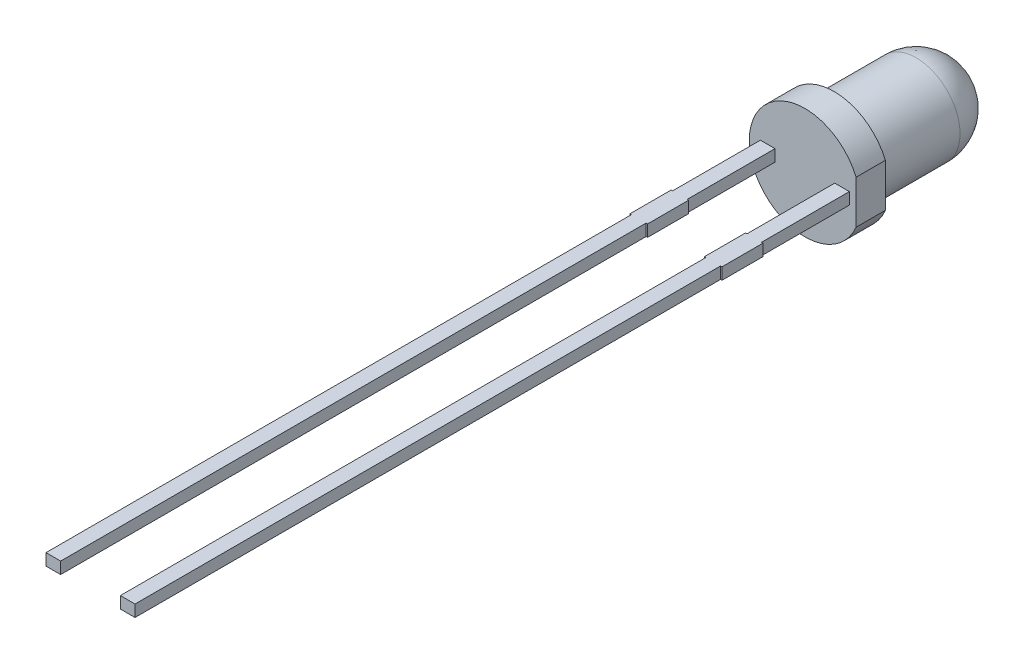
ISO-10303-21;
HEADER;
FILE_DESCRIPTION(('STEP AP214'),'2;1');
FILE_NAME('part.step','',(''),(''),'','','');
FILE_SCHEMA(('AUTOMOTIVE_DESIGN { 1 0 10303 214 1 1 1 1 }'));
ENDSEC;
DATA;
#1=APPLICATION_CONTEXT('core data for automotive mechanical design processes');
#2=APPLICATION_PROTOCOL_DEFINITION('international standard','automotive_design',2000,#1);
#3=PRODUCT_CONTEXT('',#1,'mechanical');
#4=PRODUCT('Part','Part','',(#3));
#5=PRODUCT_RELATED_PRODUCT_CATEGORY('part','',(#4));
#6=PRODUCT_DEFINITION_FORMATION('','',#4);
#7=PRODUCT_DEFINITION_CONTEXT('part definition',#1,'design');
#8=PRODUCT_DEFINITION('design','',#6,#7);
#9=PRODUCT_DEFINITION_SHAPE('','',#8);
#10=(LENGTH_UNIT() NAMED_UNIT(*) SI_UNIT(.MILLI.,.METRE.));
#11=(NAMED_UNIT(*) PLANE_ANGLE_UNIT() SI_UNIT($,.RADIAN.));
#12=(NAMED_UNIT(*) SI_UNIT($,.STERADIAN.) SOLID_ANGLE_UNIT());
#13=UNCERTAINTY_MEASURE_WITH_UNIT(LENGTH_MEASURE(1.E-05),#10,'distance_accuracy_value','');
#14=(GEOMETRIC_REPRESENTATION_CONTEXT(3) GLOBAL_UNCERTAINTY_ASSIGNED_CONTEXT((#13)) GLOBAL_UNIT_ASSIGNED_CONTEXT((#10,
#11,#12)) REPRESENTATION_CONTEXT('',''));
#15=CARTESIAN_POINT('',(0.,0.,0.));
#16=DIRECTION('',(0.,0.,1.));
#17=DIRECTION('',(1.,0.,0.));
#18=AXIS2_PLACEMENT_3D('',#15,#16,#17);
#19=CARTESIAN_POINT('',(-1.57,-0.2,5.4));
#20=DIRECTION('',(1.,0.,0.));
#21=DIRECTION('',(0.,0.,-1.));
#22=AXIS2_PLACEMENT_3D('',#19,#20,#21);
#23=PLANE('',#22);
#24=DIRECTION('',(0.,0.,1.));
#25=VECTOR('',#24,1.);
#26=CARTESIAN_POINT('',(-1.57,-0.2,4.));
#27=LINE('',#26,#25);
#28=CARTESIAN_POINT('',(-1.57,-0.2,4.));
#29=VERTEX_POINT('',#28);
#30=CARTESIAN_POINT('',(-1.57,-0.2,5.4));
#31=VERTEX_POINT('',#30);
#32=EDGE_CURVE('P0_E385',#29,#31,#27,.T.);
#33=ORIENTED_EDGE('',*,*,#32,.T.);
#34=DIRECTION('',(0.,-1.,0.));
#35=VECTOR('',#34,1.);
#36=CARTESIAN_POINT('',(-1.57,0.2,5.4));
#37=LINE('',#36,#35);
#38=CARTESIAN_POINT('',(-1.57,0.2,5.4));
#39=VERTEX_POINT('',#38);
#40=EDGE_CURVE('P0_E465',#39,#31,#37,.T.);
#41=ORIENTED_EDGE('',*,*,#40,.F.);
#42=DIRECTION('',(0.,0.,-1.));
#43=VECTOR('',#42,1.);
#44=CARTESIAN_POINT('',(-1.57,0.2,4.));
#45=LINE('',#44,#43);
#46=CARTESIAN_POINT('',(-1.57,0.2,4.));
#47=VERTEX_POINT('',#46);
#48=EDGE_CURVE('P0_E414',#39,#47,#45,.T.);
#49=ORIENTED_EDGE('',*,*,#48,.T.);
#50=DIRECTION('',(0.,1.,0.));
#51=VECTOR('',#50,1.);
#52=CARTESIAN_POINT('',(-1.57,0.2,4.));
#53=LINE('',#52,#51);
#54=EDGE_CURVE('P0_E402',#29,#47,#53,.T.);
#55=ORIENTED_EDGE('',*,*,#54,.F.);
#56=EDGE_LOOP('',(#33,#41,#49,#55));
#57=FACE_BOUND('',#56,.T.);
#58=ADVANCED_FACE('P0_F48',(#57),#23,.F.);
#59=CARTESIAN_POINT('',(-1.02,0.2,25.4));
#60=DIRECTION('',(0.,0.,-1.));
#61=DIRECTION('',(-1.,0.,0.));
#62=AXIS2_PLACEMENT_3D('',#59,#60,#61);
#63=PLANE('',#62);
#64=DIRECTION('',(-1.,0.,0.));
#65=VECTOR('',#64,1.);
#66=CARTESIAN_POINT('',(-1.52,-0.2,25.4));
#67=LINE('',#66,#65);
#68=CARTESIAN_POINT('',(-1.52,-0.2,25.4));
#69=VERTEX_POINT('',#68);
#70=CARTESIAN_POINT('',(-1.02,-0.2,25.4));
#71=VERTEX_POINT('',#70);
#72=EDGE_CURVE('P0_E376',#69,#71,#67,.F.);
#73=ORIENTED_EDGE('',*,*,#72,.T.);
#74=DIRECTION('',(0.,-1.,0.));
#75=VECTOR('',#74,1.);
#76=CARTESIAN_POINT('',(-1.02,0.2,25.4));
#77=LINE('',#76,#75);
#78=CARTESIAN_POINT('',(-1.02,0.2,25.4));
#79=VERTEX_POINT('',#78);
#80=EDGE_CURVE('P0_E377',#79,#71,#77,.T.);
#81=ORIENTED_EDGE('',*,*,#80,.F.);
#82=DIRECTION('',(1.,0.,0.));
#83=VECTOR('',#82,1.);
#84=CARTESIAN_POINT('',(-1.52,0.2,25.4));
#85=LINE('',#84,#83);
#86=CARTESIAN_POINT('',(-1.52,0.2,25.4));
#87=VERTEX_POINT('',#86);
#88=EDGE_CURVE('P0_E416',#79,#87,#85,.F.);
#89=ORIENTED_EDGE('',*,*,#88,.T.);
#90=DIRECTION('',(0.,-1.,0.));
#91=VECTOR('',#90,1.);
#92=CARTESIAN_POINT('',(-1.52,0.2,25.4));
#93=LINE('',#92,#91);
#94=EDGE_CURVE('P0_E380',#87,#69,#93,.T.);
#95=ORIENTED_EDGE('',*,*,#94,.T.);
#96=EDGE_LOOP('',(#73,#81,#89,#95));
#97=FACE_BOUND('',#96,.T.);
#98=ADVANCED_FACE('P0_F364',(#97),#63,.F.);
#99=CARTESIAN_POINT('',(-0.97,-0.2,5.4));
#100=DIRECTION('',(-1.,0.,0.));
#101=DIRECTION('',(0.,0.,1.));
#102=AXIS2_PLACEMENT_3D('',#99,#100,#101);
#103=PLANE('',#102);
#104=DIRECTION('',(0.,0.,-1.));
#105=VECTOR('',#104,1.);
#106=CARTESIAN_POINT('',(-0.97,0.2,4.));
#107=LINE('',#106,#105);
#108=CARTESIAN_POINT('',(-0.97,0.2,4.));
#109=VERTEX_POINT('',#108);
#110=CARTESIAN_POINT('',(-0.97,0.2,5.4));
#111=VERTEX_POINT('',#110);
#112=EDGE_CURVE('P0_E419',#109,#111,#107,.F.);
#113=ORIENTED_EDGE('',*,*,#112,.T.);
#114=DIRECTION('',(0.,-1.,0.));
#115=VECTOR('',#114,1.);
#116=CARTESIAN_POINT('',(-0.97,0.2,5.4));
#117=LINE('',#116,#115);
#118=CARTESIAN_POINT('',(-0.97,-0.2,5.4));
#119=VERTEX_POINT('',#118);
#120=EDGE_CURVE('P0_E586',#111,#119,#117,.T.);
#121=ORIENTED_EDGE('',*,*,#120,.T.);
#122=DIRECTION('',(0.,0.,1.));
#123=VECTOR('',#122,1.);
#124=CARTESIAN_POINT('',(-0.97,-0.2,4.));
#125=LINE('',#124,#123);
#126=CARTESIAN_POINT('',(-0.97,-0.2,4.));
#127=VERTEX_POINT('',#126);
#128=EDGE_CURVE('P0_E384',#119,#127,#125,.F.);
#129=ORIENTED_EDGE('',*,*,#128,.T.);
#130=DIRECTION('',(0.,1.,0.));
#131=VECTOR('',#130,1.);
#132=CARTESIAN_POINT('',(-0.97,0.2,4.));
#133=LINE('',#132,#131);
#134=EDGE_CURVE('P0_E446',#109,#127,#133,.F.);
#135=ORIENTED_EDGE('',*,*,#134,.F.);
#136=EDGE_LOOP('',(#113,#121,#129,#135));
#137=FACE_BOUND('',#136,.T.);
#138=ADVANCED_FACE('P0_F361',(#137),#103,.F.);
#139=CARTESIAN_POINT('',(-0.97,0.2,4.));
#140=DIRECTION('',(0.,0.,-1.));
#141=DIRECTION('',(-1.,0.,0.));
#142=AXIS2_PLACEMENT_3D('',#139,#140,#141);
#143=PLANE('',#142);
#144=DIRECTION('',(1.,0.,0.));
#145=VECTOR('',#144,1.);
#146=CARTESIAN_POINT('',(-1.52,0.2,4.));
#147=LINE('',#146,#145);
#148=CARTESIAN_POINT('',(-1.02,0.2,4.));
#149=VERTEX_POINT('',#148);
#150=EDGE_CURVE('P0_E423',#149,#109,#147,.T.);
#151=ORIENTED_EDGE('',*,*,#150,.T.);
#152=ORIENTED_EDGE('',*,*,#134,.T.);
#153=DIRECTION('',(-1.,0.,0.));
#154=VECTOR('',#153,1.);
#155=CARTESIAN_POINT('',(-1.52,-0.2,4.));
#156=LINE('',#155,#154);
#157=CARTESIAN_POINT('',(-1.02,-0.2,4.));
#158=VERTEX_POINT('',#157);
#159=EDGE_CURVE('P0_E391',#127,#158,#156,.T.);
#160=ORIENTED_EDGE('',*,*,#159,.T.);
#161=DIRECTION('',(0.,1.,0.));
#162=VECTOR('',#161,1.);
#163=CARTESIAN_POINT('',(-1.02,-0.2,4.));
#164=LINE('',#163,#162);
#165=EDGE_CURVE('P0_E443',#158,#149,#164,.T.);
#166=ORIENTED_EDGE('',*,*,#165,.T.);
#167=EDGE_LOOP('',(#151,#152,#160,#166));
#168=FACE_BOUND('',#167,.T.);
#169=ADVANCED_FACE('P0_F357',(#168),#143,.T.);
#170=CARTESIAN_POINT('',(-1.02,-0.2,4.));
#171=DIRECTION('',(-1.,0.,0.));
#172=DIRECTION('',(0.,0.,1.));
#173=AXIS2_PLACEMENT_3D('',#170,#171,#172);
#174=PLANE('',#173);
#175=DIRECTION('',(0.,0.,-1.));
#176=VECTOR('',#175,1.);
#177=CARTESIAN_POINT('',(-1.02,0.2,4.));
#178=LINE('',#177,#176);
#179=CARTESIAN_POINT('',(-1.02,0.2,1.));
#180=VERTEX_POINT('',#179);
#181=EDGE_CURVE('P0_E427',#180,#149,#178,.F.);
#182=ORIENTED_EDGE('',*,*,#181,.T.);
#183=ORIENTED_EDGE('',*,*,#165,.F.);
#184=DIRECTION('',(0.,0.,1.));
#185=VECTOR('',#184,1.);
#186=CARTESIAN_POINT('',(-1.02,-0.2,4.));
#187=LINE('',#186,#185);
#188=CARTESIAN_POINT('',(-1.02,-0.2,1.));
#189=VERTEX_POINT('',#188);
#190=EDGE_CURVE('P0_E563',#158,#189,#187,.F.);
#191=ORIENTED_EDGE('',*,*,#190,.T.);
#192=DIRECTION('',(0.,1.,0.));
#193=VECTOR('',#192,1.);
#194=CARTESIAN_POINT('',(-1.02,-0.2,1.));
#195=LINE('',#194,#193);
#196=EDGE_CURVE('P0_E440',#180,#189,#195,.F.);
#197=ORIENTED_EDGE('',*,*,#196,.F.);
#198=EDGE_LOOP('',(#182,#183,#191,#197));
#199=FACE_BOUND('',#198,.T.);
#200=ADVANCED_FACE('P0_F353',(#199),#174,.F.);
#201=CARTESIAN_POINT('',(0.97,-0.2,5.4));
#202=DIRECTION('',(1.,0.,0.));
#203=DIRECTION('',(0.,1.,0.));
#204=AXIS2_PLACEMENT_3D('',#201,#202,#203);
#205=PLANE('',#204);
#206=DIRECTION('',(0.,0.,1.));
#207=VECTOR('',#206,1.);
#208=CARTESIAN_POINT('',(0.97,-0.2,4.));
#209=LINE('',#208,#207);
#210=CARTESIAN_POINT('',(0.97,-0.2,4.));
#211=VERTEX_POINT('',#210);
#212=CARTESIAN_POINT('',(0.97,-0.2,5.4));
#213=VERTEX_POINT('',#212);
#214=EDGE_CURVE('P0_E524',#211,#213,#209,.T.);
#215=ORIENTED_EDGE('',*,*,#214,.T.);
#216=DIRECTION('',(0.,-1.,0.));
#217=VECTOR('',#216,1.);
#218=CARTESIAN_POINT('',(0.97,0.2,5.4));
#219=LINE('',#218,#217);
#220=CARTESIAN_POINT('',(0.97,0.2,5.4));
#221=VERTEX_POINT('',#220);
#222=EDGE_CURVE('P0_E72',#221,#213,#219,.T.);
#223=ORIENTED_EDGE('',*,*,#222,.F.);
#224=DIRECTION('',(0.,0.,-1.));
#225=VECTOR('',#224,1.);
#226=CARTESIAN_POINT('',(0.97,0.2,4.));
#227=LINE('',#226,#225);
#228=CARTESIAN_POINT('',(0.969999999999997,0.2,4.));
#229=VERTEX_POINT('',#228);
#230=EDGE_CURVE('P0_E543',#221,#229,#227,.T.);
#231=ORIENTED_EDGE('',*,*,#230,.T.);
#232=DIRECTION('',(0.,1.,0.));
#233=VECTOR('',#232,1.);
#234=CARTESIAN_POINT('',(0.97,0.2,4.));
#235=LINE('',#234,#233);
#236=EDGE_CURVE('P0_E536',#229,#211,#235,.F.);
#237=ORIENTED_EDGE('',*,*,#236,.T.);
#238=EDGE_LOOP('',(#215,#223,#231,#237));
#239=FACE_BOUND('',#238,.T.);
#240=ADVANCED_FACE('P0_F349',(#239),#205,.F.);
#241=CARTESIAN_POINT('',(1.52,0.2,25.4));
#242=DIRECTION('',(0.,0.,1.));
#243=DIRECTION('',(1.,0.,0.));
#244=AXIS2_PLACEMENT_3D('',#241,#242,#243);
#245=PLANE('',#244);
#246=DIRECTION('',(0.,-1.,0.));
#247=VECTOR('',#246,1.);
#248=CARTESIAN_POINT('',(1.52,0.2,25.4));
#249=LINE('',#248,#247);
#250=CARTESIAN_POINT('',(1.52,0.2,25.4));
#251=VERTEX_POINT('',#250);
#252=CARTESIAN_POINT('',(1.52,-0.2,25.4));
#253=VERTEX_POINT('',#252);
#254=EDGE_CURVE('P0_E64',#251,#253,#249,.T.);
#255=ORIENTED_EDGE('',*,*,#254,.F.);
#256=DIRECTION('',(1.,0.,0.));
#257=VECTOR('',#256,1.);
#258=CARTESIAN_POINT('',(1.52,0.2,25.4));
#259=LINE('',#258,#257);
#260=CARTESIAN_POINT('',(1.02,0.2,25.4));
#261=VERTEX_POINT('',#260);
#262=EDGE_CURVE('P0_E546',#251,#261,#259,.F.);
#263=ORIENTED_EDGE('',*,*,#262,.T.);
#264=DIRECTION('',(0.,-1.,0.));
#265=VECTOR('',#264,1.);
#266=CARTESIAN_POINT('',(1.02,0.2,25.4));
#267=LINE('',#266,#265);
#268=CARTESIAN_POINT('',(1.02,-0.2,25.4));
#269=VERTEX_POINT('',#268);
#270=EDGE_CURVE('P0_E594',#261,#269,#267,.T.);
#271=ORIENTED_EDGE('',*,*,#270,.T.);
#272=DIRECTION('',(-1.,0.,0.));
#273=VECTOR('',#272,1.);
#274=CARTESIAN_POINT('',(1.52,-0.2,25.4));
#275=LINE('',#274,#273);
#276=EDGE_CURVE('P0_E520',#269,#253,#275,.F.);
#277=ORIENTED_EDGE('',*,*,#276,.T.);
#278=EDGE_LOOP('',(#255,#263,#271,#277));
#279=FACE_BOUND('',#278,.T.);
#280=ADVANCED_FACE('P0_F345',(#279),#245,.T.);
#281=CARTESIAN_POINT('',(1.57,-0.2,5.4));
#282=DIRECTION('',(-1.,0.,0.));
#283=DIRECTION('',(0.,-1.,0.));
#284=AXIS2_PLACEMENT_3D('',#281,#282,#283);
#285=PLANE('',#284);
#286=DIRECTION('',(0.,0.,-1.));
#287=VECTOR('',#286,1.);
#288=CARTESIAN_POINT('',(1.57,0.2,4.));
#289=LINE('',#288,#287);
#290=CARTESIAN_POINT('',(1.57,0.2,4.));
#291=VERTEX_POINT('',#290);
#292=CARTESIAN_POINT('',(1.57,0.2,5.4));
#293=VERTEX_POINT('',#292);
#294=EDGE_CURVE('P0_E548',#291,#293,#289,.F.);
#295=ORIENTED_EDGE('',*,*,#294,.T.);
#296=DIRECTION('',(0.,-1.,0.));
#297=VECTOR('',#296,1.);
#298=CARTESIAN_POINT('',(1.57,0.2,5.4));
#299=LINE('',#298,#297);
#300=CARTESIAN_POINT('',(1.57,-0.2,5.4));
#301=VERTEX_POINT('',#300);
#302=EDGE_CURVE('P0_E633',#293,#301,#299,.T.);
#303=ORIENTED_EDGE('',*,*,#302,.T.);
#304=DIRECTION('',(0.,0.,1.));
#305=VECTOR('',#304,1.);
#306=CARTESIAN_POINT('',(1.57,-0.2,4.));
#307=LINE('',#306,#305);
#308=CARTESIAN_POINT('',(1.57,-0.2,4.));
#309=VERTEX_POINT('',#308);
#310=EDGE_CURVE('P0_E517',#301,#309,#307,.F.);
#311=ORIENTED_EDGE('',*,*,#310,.T.);
#312=DIRECTION('',(0.,1.,0.));
#313=VECTOR('',#312,1.);
#314=CARTESIAN_POINT('',(1.57,0.2,4.));
#315=LINE('',#314,#313);
#316=EDGE_CURVE('P0_E437',#309,#291,#315,.T.);
#317=ORIENTED_EDGE('',*,*,#316,.T.);
#318=EDGE_LOOP('',(#295,#303,#311,#317));
#319=FACE_BOUND('',#318,.T.);
#320=ADVANCED_FACE('P0_F341',(#319),#285,.F.);
#321=CARTESIAN_POINT('',(1.57,0.2,4.));
#322=DIRECTION('',(0.,0.,1.));
#323=DIRECTION('',(1.,0.,0.));
#324=AXIS2_PLACEMENT_3D('',#321,#322,#323);
#325=PLANE('',#324);
#326=DIRECTION('',(0.,1.,0.));
#327=VECTOR('',#326,1.);
#328=CARTESIAN_POINT('',(1.52,-0.2,4.));
#329=LINE('',#328,#327);
#330=CARTESIAN_POINT('',(1.52,-0.2,4.));
#331=VERTEX_POINT('',#330);
#332=CARTESIAN_POINT('',(1.52,0.2,4.));
#333=VERTEX_POINT('',#332);
#334=EDGE_CURVE('P0_E434',#331,#333,#329,.T.);
#335=ORIENTED_EDGE('',*,*,#334,.T.);
#336=DIRECTION('',(1.,0.,0.));
#337=VECTOR('',#336,1.);
#338=CARTESIAN_POINT('',(1.52,0.2,4.));
#339=LINE('',#338,#337);
#340=EDGE_CURVE('P0_E552',#333,#291,#339,.T.);
#341=ORIENTED_EDGE('',*,*,#340,.T.);
#342=ORIENTED_EDGE('',*,*,#316,.F.);
#343=DIRECTION('',(-1.,0.,0.));
#344=VECTOR('',#343,1.);
#345=CARTESIAN_POINT('',(1.52,-0.2,4.));
#346=LINE('',#345,#344);
#347=EDGE_CURVE('P0_E514',#309,#331,#346,.T.);
#348=ORIENTED_EDGE('',*,*,#347,.T.);
#349=EDGE_LOOP('',(#335,#341,#342,#348));
#350=FACE_BOUND('',#349,.T.);
#351=ADVANCED_FACE('P0_F337',(#350),#325,.F.);
#352=CARTESIAN_POINT('',(1.52,-0.2,4.));
#353=DIRECTION('',(-1.,0.,0.));
#354=DIRECTION('',(0.,0.,1.));
#355=AXIS2_PLACEMENT_3D('',#352,#353,#354);
#356=PLANE('',#355);
#357=DIRECTION('',(0.,0.,-1.));
#358=VECTOR('',#357,1.);
#359=CARTESIAN_POINT('',(1.52,0.2,4.));
#360=LINE('',#359,#358);
#361=CARTESIAN_POINT('',(1.52,0.2,1.));
#362=VERTEX_POINT('',#361);
#363=EDGE_CURVE('P0_E556',#362,#333,#360,.F.);
#364=ORIENTED_EDGE('',*,*,#363,.T.);
#365=ORIENTED_EDGE('',*,*,#334,.F.);
#366=DIRECTION('',(0.,0.,1.));
#367=VECTOR('',#366,1.);
#368=CARTESIAN_POINT('',(1.52,-0.2,4.));
#369=LINE('',#368,#367);
#370=CARTESIAN_POINT('',(1.52,-0.2,1.));
#371=VERTEX_POINT('',#370);
#372=EDGE_CURVE('P0_E510',#331,#371,#369,.F.);
#373=ORIENTED_EDGE('',*,*,#372,.T.);
#374=DIRECTION('',(0.,1.,0.));
#375=VECTOR('',#374,1.);
#376=CARTESIAN_POINT('',(1.52,-0.2,1.));
#377=LINE('',#376,#375);
#378=EDGE_CURVE('P0_E431',#362,#371,#377,.F.);
#379=ORIENTED_EDGE('',*,*,#378,.F.);
#380=EDGE_LOOP('',(#364,#365,#373,#379));
#381=FACE_BOUND('',#380,.T.);
#382=ADVANCED_FACE('P0_F333',(#381),#356,.F.);
#383=CARTESIAN_POINT('',(-1.52,0.2,4.));
#384=DIRECTION('',(0.,-1.,0.));
#385=DIRECTION('',(0.,0.,-1.));
#386=AXIS2_PLACEMENT_3D('',#383,#384,#385);
#387=PLANE('',#386);
#388=DIRECTION('',(0.,0.,-1.));
#389=VECTOR('',#388,1.);
#390=CARTESIAN_POINT('',(-1.02,0.2,25.4));
#391=LINE('',#390,#389);
#392=CARTESIAN_POINT('',(-1.02,0.2,5.4));
#393=VERTEX_POINT('',#392);
#394=EDGE_CURVE('P0_E591',#79,#393,#391,.T.);
#395=ORIENTED_EDGE('',*,*,#394,.T.);
#396=DIRECTION('',(1.,0.,0.));
#397=VECTOR('',#396,1.);
#398=CARTESIAN_POINT('',(-1.02,0.2,5.4));
#399=LINE('',#398,#397);
#400=EDGE_CURVE('P0_E584',#393,#111,#399,.T.);
#401=ORIENTED_EDGE('',*,*,#400,.T.);
#402=ORIENTED_EDGE('',*,*,#112,.F.);
#403=ORIENTED_EDGE('',*,*,#150,.F.);
#404=ORIENTED_EDGE('',*,*,#181,.F.);
#405=DIRECTION('',(1.,0.,0.));
#406=VECTOR('',#405,1.);
#407=CARTESIAN_POINT('',(-1.52,0.2,1.));
#408=LINE('',#407,#406);
#409=CARTESIAN_POINT('',(-1.52,0.2,1.));
#410=VERTEX_POINT('',#409);
#411=EDGE_CURVE('P0_E410',#410,#180,#408,.T.);
#412=ORIENTED_EDGE('',*,*,#411,.F.);
#413=DIRECTION('',(0.,0.,-1.));
#414=VECTOR('',#413,1.);
#415=CARTESIAN_POINT('',(-1.52,0.2,4.));
#416=LINE('',#415,#414);
#417=CARTESIAN_POINT('',(-1.52,0.2,4.));
#418=VERTEX_POINT('',#417);
#419=EDGE_CURVE('P0_E504',#410,#418,#416,.F.);
#420=ORIENTED_EDGE('',*,*,#419,.T.);
#421=DIRECTION('',(-1.,0.,0.));
#422=VECTOR('',#421,1.);
#423=CARTESIAN_POINT('',(-0.97,0.2,4.));
#424=LINE('',#423,#422);
#425=EDGE_CURVE('P0_E406',#47,#418,#424,.F.);
#426=ORIENTED_EDGE('',*,*,#425,.F.);
#427=ORIENTED_EDGE('',*,*,#48,.F.);
#428=DIRECTION('',(1.,0.,0.));
#429=VECTOR('',#428,1.);
#430=CARTESIAN_POINT('',(-1.57,0.2,5.4));
#431=LINE('',#430,#429);
#432=CARTESIAN_POINT('',(-1.52,0.2,5.4));
#433=VERTEX_POINT('',#432);
#434=EDGE_CURVE('P0_E603',#39,#433,#431,.T.);
#435=ORIENTED_EDGE('',*,*,#434,.T.);
#436=DIRECTION('',(0.,0.,1.));
#437=VECTOR('',#436,1.);
#438=CARTESIAN_POINT('',(-1.52,0.2,5.4));
#439=LINE('',#438,#437);
#440=EDGE_CURVE('P0_E606',#433,#87,#439,.T.);
#441=ORIENTED_EDGE('',*,*,#440,.T.);
#442=ORIENTED_EDGE('',*,*,#88,.F.);
#443=EDGE_LOOP('',(#395,#401,#402,#403,#404,#412,#420,#426,#427,#435,#441,#442));
#444=FACE_BOUND('',#443,.T.);
#445=ADVANCED_FACE('P0_F329',(#444),#387,.F.);
#446=CARTESIAN_POINT('',(-0.97,0.2,4.));
#447=DIRECTION('',(0.,0.,-1.));
#448=DIRECTION('',(-1.,0.,0.));
#449=AXIS2_PLACEMENT_3D('',#446,#447,#448);
#450=PLANE('',#449);
#451=DIRECTION('',(-1.,0.,0.));
#452=VECTOR('',#451,1.);
#453=CARTESIAN_POINT('',(-1.52,-0.2,4.));
#454=LINE('',#453,#452);
#455=CARTESIAN_POINT('',(-1.52,-0.2,4.));
#456=VERTEX_POINT('',#455);
#457=EDGE_CURVE('P0_E395',#456,#29,#454,.T.);
#458=ORIENTED_EDGE('',*,*,#457,.T.);
#459=ORIENTED_EDGE('',*,*,#54,.T.);
#460=ORIENTED_EDGE('',*,*,#425,.T.);
#461=DIRECTION('',(0.,1.,0.));
#462=VECTOR('',#461,1.);
#463=CARTESIAN_POINT('',(-1.52,-0.2,4.));
#464=LINE('',#463,#462);
#465=EDGE_CURVE('P0_E501',#418,#456,#464,.F.);
#466=ORIENTED_EDGE('',*,*,#465,.T.);
#467=EDGE_LOOP('',(#458,#459,#460,#466));
#468=FACE_BOUND('',#467,.T.);
#469=ADVANCED_FACE('P0_F325',(#468),#450,.T.);
#470=CARTESIAN_POINT('',(-1.52,-0.2,4.));
#471=DIRECTION('',(0.,1.,0.));
#472=DIRECTION('',(-1.,0.,0.));
#473=AXIS2_PLACEMENT_3D('',#470,#471,#472);
#474=PLANE('',#473);
#475=ORIENTED_EDGE('',*,*,#128,.F.);
#476=DIRECTION('',(1.,0.,0.));
#477=VECTOR('',#476,1.);
#478=CARTESIAN_POINT('',(-1.02,-0.2,5.4));
#479=LINE('',#478,#477);
#480=CARTESIAN_POINT('',(-1.02,-0.2,5.4));
#481=VERTEX_POINT('',#480);
#482=EDGE_CURVE('P0_E588',#481,#119,#479,.T.);
#483=ORIENTED_EDGE('',*,*,#482,.F.);
#484=DIRECTION('',(0.,0.,-1.));
#485=VECTOR('',#484,1.);
#486=CARTESIAN_POINT('',(-1.02,-0.2,25.4));
#487=LINE('',#486,#485);
#488=EDGE_CURVE('P0_E590',#71,#481,#487,.T.);
#489=ORIENTED_EDGE('',*,*,#488,.F.);
#490=ORIENTED_EDGE('',*,*,#72,.F.);
#491=DIRECTION('',(0.,0.,1.));
#492=VECTOR('',#491,1.);
#493=CARTESIAN_POINT('',(-1.52,-0.2,5.4));
#494=LINE('',#493,#492);
#495=CARTESIAN_POINT('',(-1.52,-0.2,5.4));
#496=VERTEX_POINT('',#495);
#497=EDGE_CURVE('P0_E607',#496,#69,#494,.T.);
#498=ORIENTED_EDGE('',*,*,#497,.F.);
#499=DIRECTION('',(1.,0.,0.));
#500=VECTOR('',#499,1.);
#501=CARTESIAN_POINT('',(-1.57,-0.2,5.4));
#502=LINE('',#501,#500);
#503=EDGE_CURVE('P0_E599',#31,#496,#502,.T.);
#504=ORIENTED_EDGE('',*,*,#503,.F.);
#505=ORIENTED_EDGE('',*,*,#32,.F.);
#506=ORIENTED_EDGE('',*,*,#457,.F.);
#507=DIRECTION('',(0.,0.,-1.));
#508=VECTOR('',#507,1.);
#509=CARTESIAN_POINT('',(-1.52,-0.2,4.));
#510=LINE('',#509,#508);
#511=CARTESIAN_POINT('',(-1.52,-0.2,1.));
#512=VERTEX_POINT('',#511);
#513=EDGE_CURVE('P0_E497',#456,#512,#510,.T.);
#514=ORIENTED_EDGE('',*,*,#513,.T.);
#515=DIRECTION('',(-1.,0.,0.));
#516=VECTOR('',#515,1.);
#517=CARTESIAN_POINT('',(-1.52,-0.2,1.));
#518=LINE('',#517,#516);
#519=EDGE_CURVE('P0_E560',#189,#512,#518,.T.);
#520=ORIENTED_EDGE('',*,*,#519,.F.);
#521=ORIENTED_EDGE('',*,*,#190,.F.);
#522=ORIENTED_EDGE('',*,*,#159,.F.);
#523=EDGE_LOOP('',(#475,#483,#489,#490,#498,#504,#505,#506,#514,#520,#521,#522));
#524=FACE_BOUND('',#523,.T.);
#525=ADVANCED_FACE('P0_F321',(#524),#474,.F.);
#526=CARTESIAN_POINT('',(1.52,0.2,4.));
#527=DIRECTION('',(0.,-1.,0.));
#528=DIRECTION('',(0.,0.,-1.));
#529=AXIS2_PLACEMENT_3D('',#526,#527,#528);
#530=PLANE('',#529);
#531=DIRECTION('',(0.,0.,-1.));
#532=VECTOR('',#531,1.);
#533=CARTESIAN_POINT('',(1.52,0.2,25.4));
#534=LINE('',#533,#532);
#535=CARTESIAN_POINT('',(1.52,0.2,5.4));
#536=VERTEX_POINT('',#535);
#537=EDGE_CURVE('P0_E250',#251,#536,#534,.T.);
#538=ORIENTED_EDGE('',*,*,#537,.T.);
#539=DIRECTION('',(1.,0.,0.));
#540=VECTOR('',#539,1.);
#541=CARTESIAN_POINT('',(1.52,0.2,5.4));
#542=LINE('',#541,#540);
#543=EDGE_CURVE('P0_E640',#536,#293,#542,.T.);
#544=ORIENTED_EDGE('',*,*,#543,.T.);
#545=ORIENTED_EDGE('',*,*,#294,.F.);
#546=ORIENTED_EDGE('',*,*,#340,.F.);
#547=ORIENTED_EDGE('',*,*,#363,.F.);
#548=DIRECTION('',(1.,0.,0.));
#549=VECTOR('',#548,1.);
#550=CARTESIAN_POINT('',(1.52,0.2,1.));
#551=LINE('',#550,#549);
#552=CARTESIAN_POINT('',(1.02,0.2,1.));
#553=VERTEX_POINT('',#552);
#554=EDGE_CURVE('P0_E539',#553,#362,#551,.T.);
#555=ORIENTED_EDGE('',*,*,#554,.F.);
#556=DIRECTION('',(0.,0.,-1.));
#557=VECTOR('',#556,1.);
#558=CARTESIAN_POINT('',(1.02,0.2,4.));
#559=LINE('',#558,#557);
#560=CARTESIAN_POINT('',(1.02,0.2,4.));
#561=VERTEX_POINT('',#560);
#562=EDGE_CURVE('P0_E494',#553,#561,#559,.F.);
#563=ORIENTED_EDGE('',*,*,#562,.T.);
#564=DIRECTION('',(1.,0.,0.));
#565=VECTOR('',#564,1.);
#566=CARTESIAN_POINT('',(1.57,0.2,4.));
#567=LINE('',#566,#565);
#568=EDGE_CURVE('P0_E532',#561,#229,#567,.F.);
#569=ORIENTED_EDGE('',*,*,#568,.T.);
#570=ORIENTED_EDGE('',*,*,#230,.F.);
#571=DIRECTION('',(1.,0.,0.));
#572=VECTOR('',#571,1.);
#573=CARTESIAN_POINT('',(0.97,0.2,5.4));
#574=LINE('',#573,#572);
#575=CARTESIAN_POINT('',(1.02,0.2,5.4));
#576=VERTEX_POINT('',#575);
#577=EDGE_CURVE('P0_E630',#221,#576,#574,.T.);
#578=ORIENTED_EDGE('',*,*,#577,.T.);
#579=DIRECTION('',(0.,0.,1.));
#580=VECTOR('',#579,1.);
#581=CARTESIAN_POINT('',(1.02,0.2,5.4));
#582=LINE('',#581,#580);
#583=EDGE_CURVE('P0_E624',#576,#261,#582,.T.);
#584=ORIENTED_EDGE('',*,*,#583,.T.);
#585=ORIENTED_EDGE('',*,*,#262,.F.);
#586=EDGE_LOOP('',(#538,#544,#545,#546,#547,#555,#563,#569,#570,#578,#584,#585));
#587=FACE_BOUND('',#586,.T.);
#588=ADVANCED_FACE('P0_F317',(#587),#530,.F.);
#589=CARTESIAN_POINT('',(1.57,0.2,4.));
#590=DIRECTION('',(0.,0.,1.));
#591=DIRECTION('',(1.,0.,0.));
#592=AXIS2_PLACEMENT_3D('',#589,#590,#591);
#593=PLANE('',#592);
#594=DIRECTION('',(0.,1.,0.));
#595=VECTOR('',#594,1.);
#596=CARTESIAN_POINT('',(1.02,-0.2,4.));
#597=LINE('',#596,#595);
#598=CARTESIAN_POINT('',(1.02,-0.2,4.));
#599=VERTEX_POINT('',#598);
#600=EDGE_CURVE('P0_E491',#561,#599,#597,.F.);
#601=ORIENTED_EDGE('',*,*,#600,.T.);
#602=DIRECTION('',(-1.,0.,0.));
#603=VECTOR('',#602,1.);
#604=CARTESIAN_POINT('',(1.52,-0.2,4.));
#605=LINE('',#604,#603);
#606=EDGE_CURVE('P0_E528',#599,#211,#605,.T.);
#607=ORIENTED_EDGE('',*,*,#606,.T.);
#608=ORIENTED_EDGE('',*,*,#236,.F.);
#609=ORIENTED_EDGE('',*,*,#568,.F.);
#610=EDGE_LOOP('',(#601,#607,#608,#609));
#611=FACE_BOUND('',#610,.T.);
#612=ADVANCED_FACE('P0_F313',(#611),#593,.F.);
#613=CARTESIAN_POINT('',(1.52,-0.2,4.));
#614=DIRECTION('',(0.,1.,0.));
#615=DIRECTION('',(-1.,0.,0.));
#616=AXIS2_PLACEMENT_3D('',#613,#614,#615);
#617=PLANE('',#616);
#618=ORIENTED_EDGE('',*,*,#310,.F.);
#619=DIRECTION('',(1.,0.,0.));
#620=VECTOR('',#619,1.);
#621=CARTESIAN_POINT('',(1.52,-0.2,5.4));
#622=LINE('',#621,#620);
#623=CARTESIAN_POINT('',(1.52,-0.2,5.4));
#624=VERTEX_POINT('',#623);
#625=EDGE_CURVE('P0_E644',#624,#301,#622,.T.);
#626=ORIENTED_EDGE('',*,*,#625,.F.);
#627=DIRECTION('',(0.,0.,-1.));
#628=VECTOR('',#627,1.);
#629=CARTESIAN_POINT('',(1.52,-0.2,25.4));
#630=LINE('',#629,#628);
#631=EDGE_CURVE('P0_E235',#253,#624,#630,.T.);
#632=ORIENTED_EDGE('',*,*,#631,.F.);
#633=ORIENTED_EDGE('',*,*,#276,.F.);
#634=DIRECTION('',(0.,0.,1.));
#635=VECTOR('',#634,1.);
#636=CARTESIAN_POINT('',(1.02,-0.2,5.4));
#637=LINE('',#636,#635);
#638=CARTESIAN_POINT('',(1.02,-0.2,5.4));
#639=VERTEX_POINT('',#638);
#640=EDGE_CURVE('P0_E628',#639,#269,#637,.T.);
#641=ORIENTED_EDGE('',*,*,#640,.F.);
#642=DIRECTION('',(1.,0.,0.));
#643=VECTOR('',#642,1.);
#644=CARTESIAN_POINT('',(0.97,-0.2,5.4));
#645=LINE('',#644,#643);
#646=EDGE_CURVE('P0_E631',#213,#639,#645,.T.);
#647=ORIENTED_EDGE('',*,*,#646,.F.);
#648=ORIENTED_EDGE('',*,*,#214,.F.);
#649=ORIENTED_EDGE('',*,*,#606,.F.);
#650=DIRECTION('',(0.,0.,-1.));
#651=VECTOR('',#650,1.);
#652=CARTESIAN_POINT('',(1.02,-0.2,4.));
#653=LINE('',#652,#651);
#654=CARTESIAN_POINT('',(1.02,-0.2,1.));
#655=VERTEX_POINT('',#654);
#656=EDGE_CURVE('P0_E487',#599,#655,#653,.T.);
#657=ORIENTED_EDGE('',*,*,#656,.T.);
#658=DIRECTION('',(-1.,0.,0.));
#659=VECTOR('',#658,1.);
#660=CARTESIAN_POINT('',(1.52,-0.2,1.));
#661=LINE('',#660,#659);
#662=EDGE_CURVE('P0_E507',#371,#655,#661,.T.);
#663=ORIENTED_EDGE('',*,*,#662,.F.);
#664=ORIENTED_EDGE('',*,*,#372,.F.);
#665=ORIENTED_EDGE('',*,*,#347,.F.);
#666=EDGE_LOOP('',(#618,#626,#632,#633,#641,#647,#648,#649,#657,#663,#664,#665));
#667=FACE_BOUND('',#666,.T.);
#668=ADVANCED_FACE('P0_F309',(#667),#617,.F.);
#669=CARTESIAN_POINT('',(-1.52,-0.2,4.));
#670=DIRECTION('',(1.,0.,0.));
#671=DIRECTION('',(0.,0.,-1.));
#672=AXIS2_PLACEMENT_3D('',#669,#670,#671);
#673=PLANE('',#672);
#674=ORIENTED_EDGE('',*,*,#513,.F.);
#675=ORIENTED_EDGE('',*,*,#465,.F.);
#676=ORIENTED_EDGE('',*,*,#419,.F.);
#677=DIRECTION('',(0.,1.,0.));
#678=VECTOR('',#677,1.);
#679=CARTESIAN_POINT('',(-1.52,0.,1.));
#680=LINE('',#679,#678);
#681=EDGE_CURVE('P0_E483',#512,#410,#680,.T.);
#682=ORIENTED_EDGE('',*,*,#681,.F.);
#683=EDGE_LOOP('',(#674,#675,#676,#682));
#684=FACE_BOUND('',#683,.T.);
#685=ADVANCED_FACE('P0_F305',(#684),#673,.F.);
#686=CARTESIAN_POINT('',(1.02,-0.2,4.));
#687=DIRECTION('',(1.,0.,0.));
#688=DIRECTION('',(0.,0.,-1.));
#689=AXIS2_PLACEMENT_3D('',#686,#687,#688);
#690=PLANE('',#689);
#691=ORIENTED_EDGE('',*,*,#656,.F.);
#692=ORIENTED_EDGE('',*,*,#600,.F.);
#693=ORIENTED_EDGE('',*,*,#562,.F.);
#694=DIRECTION('',(0.,1.,0.));
#695=VECTOR('',#694,1.);
#696=CARTESIAN_POINT('',(1.02,0.,1.));
#697=LINE('',#696,#695);
#698=EDGE_CURVE('P0_E477',#655,#553,#697,.T.);
#699=ORIENTED_EDGE('',*,*,#698,.F.);
#700=EDGE_LOOP('',(#691,#692,#693,#699));
#701=FACE_BOUND('',#700,.T.);
#702=ADVANCED_FACE('P0_F301',(#701),#690,.F.);
#703=CARTESIAN_POINT('',(0.,0.,1.));
#704=DIRECTION('',(0.,0.,1.));
#705=DIRECTION('',(1.,0.,0.));
#706=AXIS2_PLACEMENT_3D('',#703,#704,#705);
#707=PLANE('',#706);
#708=ORIENTED_EDGE('',*,*,#662,.T.);
#709=ORIENTED_EDGE('',*,*,#698,.T.);
#710=ORIENTED_EDGE('',*,*,#554,.T.);
#711=ORIENTED_EDGE('',*,*,#378,.T.);
#712=EDGE_LOOP('',(#708,#709,#710,#711));
#713=FACE_BOUND('',#712,.T.);
#714=CARTESIAN_POINT('',(0.,0.,1.));
#715=DIRECTION('',(0.,0.,-1.));
#716=DIRECTION('',(-1.,0.,0.));
#717=AXIS2_PLACEMENT_3D('',#714,#715,#716);
#718=CIRCLE('',#717,1.9);
#719=CARTESIAN_POINT('',(1.75,-0.739932429347218,1.));
#720=VERTEX_POINT('',#719);
#721=CARTESIAN_POINT('',(1.75000000000008,0.739932429347252,1.));
#722=VERTEX_POINT('',#721);
#723=EDGE_CURVE('P0_E51',#720,#722,#718,.T.);
#724=ORIENTED_EDGE('',*,*,#723,.F.);
#725=DIRECTION('',(0.,1.,0.));
#726=VECTOR('',#725,1.);
#727=CARTESIAN_POINT('',(1.75,0.739932429347,1.));
#728=LINE('',#727,#726);
#729=EDGE_CURVE('P0_E476',#720,#722,#728,.T.);
#730=ORIENTED_EDGE('',*,*,#729,.T.);
#731=EDGE_LOOP('',(#724,#730));
#732=FACE_BOUND('',#731,.T.);
#733=ORIENTED_EDGE('',*,*,#519,.T.);
#734=ORIENTED_EDGE('',*,*,#681,.T.);
#735=ORIENTED_EDGE('',*,*,#411,.T.);
#736=ORIENTED_EDGE('',*,*,#196,.T.);
#737=EDGE_LOOP('',(#733,#734,#735,#736));
#738=FACE_BOUND('',#737,.T.);
#739=ADVANCED_FACE('P0_F297',(#713,#732,#738),#707,.T.);
#740=CARTESIAN_POINT('',(1.75,0.739932429347,1.));
#741=DIRECTION('',(-1.,0.,0.));
#742=DIRECTION('',(0.,0.,1.));
#743=AXIS2_PLACEMENT_3D('',#740,#741,#742);
#744=PLANE('',#743);
#745=DIRECTION('',(0.,0.,-1.));
#746=VECTOR('',#745,1.);
#747=CARTESIAN_POINT('',(1.75000000000016,0.739932429347066,1.));
#748=LINE('',#747,#746);
#749=CARTESIAN_POINT('',(1.75000000000008,0.739932429347252,0.));
#750=VERTEX_POINT('',#749);
#751=EDGE_CURVE('P0_E457',#722,#750,#748,.T.);
#752=ORIENTED_EDGE('',*,*,#751,.F.);
#753=ORIENTED_EDGE('',*,*,#729,.F.);
#754=DIRECTION('',(0.,0.,1.));
#755=VECTOR('',#754,1.);
#756=CARTESIAN_POINT('',(1.75,-0.739932429347,1.));
#757=LINE('',#756,#755);
#758=CARTESIAN_POINT('',(1.75,-0.739932429347218,0.));
#759=VERTEX_POINT('',#758);
#760=EDGE_CURVE('P0_E469',#759,#720,#757,.T.);
#761=ORIENTED_EDGE('',*,*,#760,.F.);
#762=DIRECTION('',(0.,1.,0.));
#763=VECTOR('',#762,1.);
#764=CARTESIAN_POINT('',(1.75,0.,0.));
#765=LINE('',#764,#763);
#766=EDGE_CURVE('P0_E449',#759,#750,#765,.T.);
#767=ORIENTED_EDGE('',*,*,#766,.T.);
#768=EDGE_LOOP('',(#752,#753,#761,#767));
#769=FACE_BOUND('',#768,.T.);
#770=ADVANCED_FACE('P0_F293',(#769),#744,.F.);
#771=CARTESIAN_POINT('',(0.,0.,1.));
#772=DIRECTION('',(0.,0.,-1.));
#773=DIRECTION('',(-1.,0.,0.));
#774=AXIS2_PLACEMENT_3D('',#771,#772,#773);
#775=CYLINDRICAL_SURFACE('',#774,1.9);
#776=ORIENTED_EDGE('',*,*,#751,.T.);
#777=CARTESIAN_POINT('',(0.,0.,0.));
#778=DIRECTION('',(0.,0.,-1.));
#779=DIRECTION('',(-1.,0.,0.));
#780=AXIS2_PLACEMENT_3D('',#777,#778,#779);
#781=CIRCLE('',#780,1.9);
#782=EDGE_CURVE('P0_E56',#750,#759,#781,.F.);
#783=ORIENTED_EDGE('',*,*,#782,.T.);
#784=ORIENTED_EDGE('',*,*,#760,.T.);
#785=ORIENTED_EDGE('',*,*,#723,.T.);
#786=EDGE_LOOP('',(#776,#783,#784,#785));
#787=FACE_BOUND('',#786,.T.);
#788=ADVANCED_FACE('P0_F289',(#787),#775,.T.);
#789=CARTESIAN_POINT('',(0.,0.,0.));
#790=DIRECTION('',(0.,0.,1.));
#791=DIRECTION('',(1.,0.,0.));
#792=AXIS2_PLACEMENT_3D('',#789,#790,#791);
#793=PLANE('',#792);
#794=CARTESIAN_POINT('',(0.,0.,0.));
#795=DIRECTION('',(0.,0.,-1.));
#796=DIRECTION('',(-1.,0.,0.));
#797=AXIS2_PLACEMENT_3D('',#794,#795,#796);
#798=CIRCLE('',#797,1.5);
#799=CARTESIAN_POINT('',(-1.5,0.,0.));
#800=VERTEX_POINT('',#799);
#801=EDGE_CURVE('P0_E12',#800,#800,#798,.T.);
#802=ORIENTED_EDGE('',*,*,#801,.F.);
#803=EDGE_LOOP('',(#802));
#804=FACE_BOUND('',#803,.T.);
#805=ORIENTED_EDGE('',*,*,#766,.F.);
#806=ORIENTED_EDGE('',*,*,#782,.F.);
#807=EDGE_LOOP('',(#805,#806));
#808=FACE_BOUND('',#807,.T.);
#809=ADVANCED_FACE('P0_F282',(#804,#808),#793,.F.);
#810=CARTESIAN_POINT('',(-1.52,0.2,5.4));
#811=DIRECTION('',(1.,0.,0.));
#812=DIRECTION('',(0.,1.,0.));
#813=AXIS2_PLACEMENT_3D('',#810,#811,#812);
#814=PLANE('',#813);
#815=ORIENTED_EDGE('',*,*,#497,.T.);
#816=ORIENTED_EDGE('',*,*,#94,.F.);
#817=ORIENTED_EDGE('',*,*,#440,.F.);
#818=DIRECTION('',(0.,-1.,0.));
#819=VECTOR('',#818,1.);
#820=CARTESIAN_POINT('',(-1.52,0.2,5.4));
#821=LINE('',#820,#819);
#822=EDGE_CURVE('P0_E613',#433,#496,#821,.T.);
#823=ORIENTED_EDGE('',*,*,#822,.T.);
#824=EDGE_LOOP('',(#815,#816,#817,#823));
#825=FACE_BOUND('',#824,.T.);
#826=ADVANCED_FACE('P0_F279',(#825),#814,.F.);
#827=CARTESIAN_POINT('',(-1.57,0.2,5.4));
#828=DIRECTION('',(0.,0.,-1.));
#829=DIRECTION('',(-1.,0.,0.));
#830=AXIS2_PLACEMENT_3D('',#827,#828,#829);
#831=PLANE('',#830);
#832=ORIENTED_EDGE('',*,*,#503,.T.);
#833=ORIENTED_EDGE('',*,*,#822,.F.);
#834=ORIENTED_EDGE('',*,*,#434,.F.);
#835=ORIENTED_EDGE('',*,*,#40,.T.);
#836=EDGE_LOOP('',(#832,#833,#834,#835));
#837=FACE_BOUND('',#836,.T.);
#838=ADVANCED_FACE('P0_F274',(#837),#831,.F.);
#839=CARTESIAN_POINT('',(-1.02,0.2,5.4));
#840=DIRECTION('',(0.,0.,-1.));
#841=DIRECTION('',(-1.,0.,0.));
#842=AXIS2_PLACEMENT_3D('',#839,#840,#841);
#843=PLANE('',#842);
#844=ORIENTED_EDGE('',*,*,#482,.T.);
#845=ORIENTED_EDGE('',*,*,#120,.F.);
#846=ORIENTED_EDGE('',*,*,#400,.F.);
#847=DIRECTION('',(0.,-1.,0.));
#848=VECTOR('',#847,1.);
#849=CARTESIAN_POINT('',(-1.02,0.2,5.4));
#850=LINE('',#849,#848);
#851=EDGE_CURVE('P0_E600',#393,#481,#850,.T.);
#852=ORIENTED_EDGE('',*,*,#851,.T.);
#853=EDGE_LOOP('',(#844,#845,#846,#852));
#854=FACE_BOUND('',#853,.T.);
#855=ADVANCED_FACE('P0_F271',(#854),#843,.F.);
#856=CARTESIAN_POINT('',(-1.02,0.2,25.4));
#857=DIRECTION('',(-1.,0.,0.));
#858=DIRECTION('',(0.,-1.,0.));
#859=AXIS2_PLACEMENT_3D('',#856,#857,#858);
#860=PLANE('',#859);
#861=ORIENTED_EDGE('',*,*,#488,.T.);
#862=ORIENTED_EDGE('',*,*,#851,.F.);
#863=ORIENTED_EDGE('',*,*,#394,.F.);
#864=ORIENTED_EDGE('',*,*,#80,.T.);
#865=EDGE_LOOP('',(#861,#862,#863,#864));
#866=FACE_BOUND('',#865,.T.);
#867=ADVANCED_FACE('P0_F267',(#866),#860,.F.);
#868=CARTESIAN_POINT('',(1.02,0.2,5.4));
#869=DIRECTION('',(1.,0.,0.));
#870=DIRECTION('',(0.,1.,0.));
#871=AXIS2_PLACEMENT_3D('',#868,#869,#870);
#872=PLANE('',#871);
#873=ORIENTED_EDGE('',*,*,#640,.T.);
#874=ORIENTED_EDGE('',*,*,#270,.F.);
#875=ORIENTED_EDGE('',*,*,#583,.F.);
#876=DIRECTION('',(0.,-1.,0.));
#877=VECTOR('',#876,1.);
#878=CARTESIAN_POINT('',(1.02,0.2,5.4));
#879=LINE('',#878,#877);
#880=EDGE_CURVE('P0_E623',#576,#639,#879,.T.);
#881=ORIENTED_EDGE('',*,*,#880,.T.);
#882=EDGE_LOOP('',(#873,#874,#875,#881));
#883=FACE_BOUND('',#882,.T.);
#884=ADVANCED_FACE('P0_F264',(#883),#872,.F.);
#885=CARTESIAN_POINT('',(0.97,0.2,5.4));
#886=DIRECTION('',(0.,0.,-1.));
#887=DIRECTION('',(-1.,0.,0.));
#888=AXIS2_PLACEMENT_3D('',#885,#886,#887);
#889=PLANE('',#888);
#890=ORIENTED_EDGE('',*,*,#646,.T.);
#891=ORIENTED_EDGE('',*,*,#880,.F.);
#892=ORIENTED_EDGE('',*,*,#577,.F.);
#893=ORIENTED_EDGE('',*,*,#222,.T.);
#894=EDGE_LOOP('',(#890,#891,#892,#893));
#895=FACE_BOUND('',#894,.T.);
#896=ADVANCED_FACE('P0_F260',(#895),#889,.F.);
#897=CARTESIAN_POINT('',(1.52,0.2,5.4));
#898=DIRECTION('',(0.,0.,-1.));
#899=DIRECTION('',(-1.,0.,0.));
#900=AXIS2_PLACEMENT_3D('',#897,#898,#899);
#901=PLANE('',#900);
#902=ORIENTED_EDGE('',*,*,#625,.T.);
#903=ORIENTED_EDGE('',*,*,#302,.F.);
#904=ORIENTED_EDGE('',*,*,#543,.F.);
#905=DIRECTION('',(0.,-1.,0.));
#906=VECTOR('',#905,1.);
#907=CARTESIAN_POINT('',(1.52,0.2,5.4));
#908=LINE('',#907,#906);
#909=EDGE_CURVE('P0_E639',#536,#624,#908,.T.);
#910=ORIENTED_EDGE('',*,*,#909,.T.);
#911=EDGE_LOOP('',(#902,#903,#904,#910));
#912=FACE_BOUND('',#911,.T.);
#913=ADVANCED_FACE('P0_F257',(#912),#901,.F.);
#914=CARTESIAN_POINT('',(1.52,0.2,25.4));
#915=DIRECTION('',(-1.,0.,0.));
#916=DIRECTION('',(0.,-1.,0.));
#917=AXIS2_PLACEMENT_3D('',#914,#915,#916);
#918=PLANE('',#917);
#919=ORIENTED_EDGE('',*,*,#631,.T.);
#920=ORIENTED_EDGE('',*,*,#909,.F.);
#921=ORIENTED_EDGE('',*,*,#537,.F.);
#922=ORIENTED_EDGE('',*,*,#254,.T.);
#923=EDGE_LOOP('',(#919,#920,#921,#922));
#924=FACE_BOUND('',#923,.T.);
#925=ADVANCED_FACE('P0_F256',(#924),#918,.F.);
#926=CARTESIAN_POINT('',(0.,0.,-2.8));
#927=DIRECTION('',(-1.,0.,0.));
#928=DIRECTION('',(0.,0.,-1.));
#929=AXIS2_PLACEMENT_3D('',#926,#927,#928);
#930=SPHERICAL_SURFACE('',#929,1.5);
#931=CARTESIAN_POINT('',(0.,0.,-2.8));
#932=DIRECTION('',(0.,0.,1.));
#933=DIRECTION('',(1.,0.,0.));
#934=AXIS2_PLACEMENT_3D('',#931,#932,#933);
#935=CIRCLE('',#934,1.5);
#936=CARTESIAN_POINT('',(1.5,0.,-2.8));
#937=VERTEX_POINT('',#936);
#938=CARTESIAN_POINT('',(-1.5,0.,-2.8));
#939=VERTEX_POINT('',#938);
#940=EDGE_CURVE('P0_E229',#937,#939,#935,.T.);
#941=ORIENTED_EDGE('',*,*,#940,.F.);
#942=CARTESIAN_POINT('',(0.,0.,-2.8));
#943=DIRECTION('',(0.,0.,1.));
#944=DIRECTION('',(1.,0.,0.));
#945=AXIS2_PLACEMENT_3D('',#942,#943,#944);
#946=CIRCLE('',#945,1.5);
#947=EDGE_CURVE('P0_E232',#939,#937,#946,.T.);
#948=ORIENTED_EDGE('',*,*,#947,.F.);
#949=EDGE_LOOP('',(#941,#948));
#950=FACE_BOUND('',#949,.T.);
#951=ADVANCED_FACE('P0_F231',(#950),#930,.T.);
#952=CARTESIAN_POINT('',(0.,0.,-4.301));
#953=DIRECTION('',(0.,0.,1.));
#954=DIRECTION('',(1.,0.,0.));
#955=AXIS2_PLACEMENT_3D('',#952,#953,#954);
#956=CYLINDRICAL_SURFACE('',#955,1.5);
#957=ORIENTED_EDGE('',*,*,#947,.T.);
#958=ORIENTED_EDGE('',*,*,#940,.T.);
#959=EDGE_LOOP('',(#957,#958));
#960=FACE_BOUND('',#959,.T.);
#961=ORIENTED_EDGE('',*,*,#801,.T.);
#962=EDGE_LOOP('',(#961));
#963=FACE_BOUND('',#962,.T.);
#964=ADVANCED_FACE('P0_F237',(#960,#963),#956,.T.);
#965=CLOSED_SHELL('',(#58,#98,#138,#169,#200,#240,#280,#320,#351,#382,#445,#469,#525,#588,#612,
#668,#685,#702,#739,#770,#788,#809,#826,#838,#855,#867,#884,#896,#913,#925,#951,#964));
#966=MANIFOLD_SOLID_BREP('P0_B2',#965);
#967=CARTESIAN_POINT('',(0.,0.,-2.8));
#968=DIRECTION('',(-1.,0.,0.));
#969=DIRECTION('',(0.,0.,-1.));
#970=AXIS2_PLACEMENT_3D('',#967,#968,#969);
#971=SPHERICAL_SURFACE('',#970,1.5);
#972=CARTESIAN_POINT('',(0.,0.,-2.8));
#973=DIRECTION('',(0.,0.,1.));
#974=DIRECTION('',(1.,0.,0.));
#975=AXIS2_PLACEMENT_3D('',#972,#973,#974);
#976=CIRCLE('',#975,1.5);
#977=CARTESIAN_POINT('',(1.5,0.,-2.8));
#978=VERTEX_POINT('',#977);
#979=CARTESIAN_POINT('',(-1.5,0.,-2.8));
#980=VERTEX_POINT('',#979);
#981=EDGE_CURVE('P1_E24',#978,#980,#976,.T.);
#982=ORIENTED_EDGE('',*,*,#981,.F.);
#983=CARTESIAN_POINT('',(0.,0.,-2.8));
#984=DIRECTION('',(0.,0.,1.));
#985=DIRECTION('',(1.,0.,0.));
#986=AXIS2_PLACEMENT_3D('',#983,#984,#985);
#987=CIRCLE('',#986,1.5);
#988=EDGE_CURVE('P1_E11',#980,#978,#987,.T.);
#989=ORIENTED_EDGE('',*,*,#988,.F.);
#990=EDGE_LOOP('',(#982,#989));
#991=FACE_BOUND('',#990,.T.);
#992=ADVANCED_FACE('P1_F17',(#991),#971,.T.);
#993=OPEN_SHELL('',(#992));
#994=SHELL_BASED_SURFACE_MODEL('P1_B1',(#993));
#995=ADVANCED_BREP_SHAPE_REPRESENTATION('',(#18,#966),#14);
#996=MANIFOLD_SURFACE_SHAPE_REPRESENTATION('',(#18,#994),#14);
#997=SHAPE_REPRESENTATION('',(#18),#14);
#998=SHAPE_DEFINITION_REPRESENTATION(#9,#997);
#999=SHAPE_REPRESENTATION_RELATIONSHIP('','',#997,#995);
#1000=SHAPE_REPRESENTATION_RELATIONSHIP('','',#997,#996);
ENDSEC;
END-ISO-10303-21;
